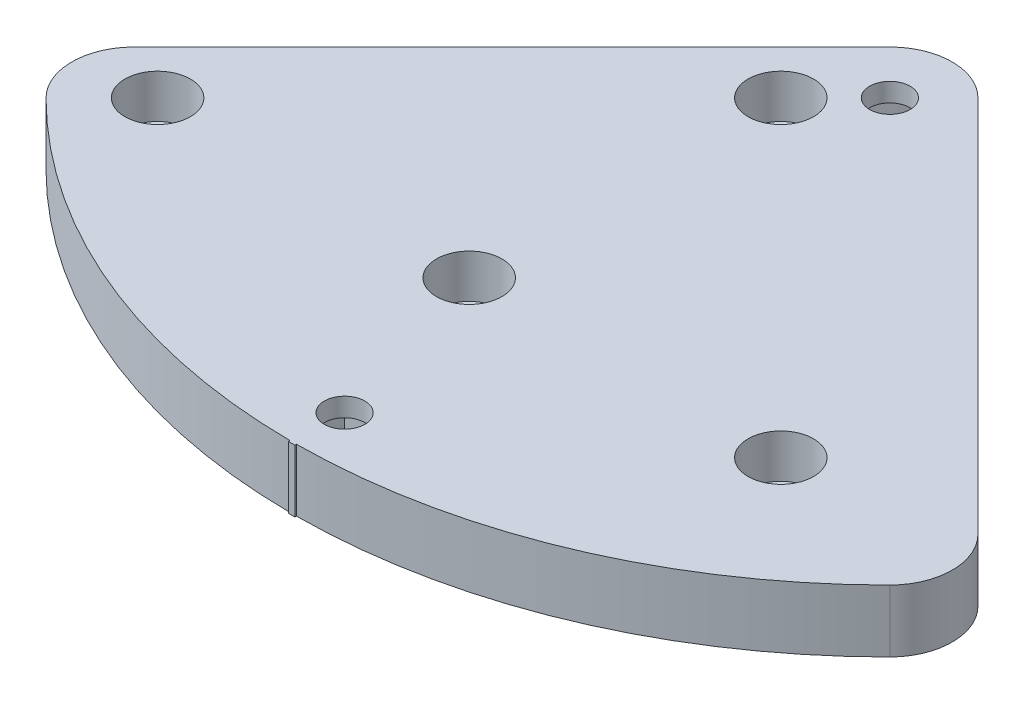
ISO-10303-21;
HEADER;
FILE_DESCRIPTION(('STEP AP214'),'2;1');
FILE_NAME('part.step','',(''),(''),'','','');
FILE_SCHEMA(('AUTOMOTIVE_DESIGN { 1 0 10303 214 1 1 1 1 }'));
ENDSEC;
DATA;
#1=APPLICATION_CONTEXT('core data for automotive mechanical design processes');
#2=APPLICATION_PROTOCOL_DEFINITION('international standard','automotive_design',2000,#1);
#3=PRODUCT_CONTEXT('',#1,'mechanical');
#4=PRODUCT('Part','Part','',(#3));
#5=PRODUCT_RELATED_PRODUCT_CATEGORY('part','',(#4));
#6=PRODUCT_DEFINITION_FORMATION('','',#4);
#7=PRODUCT_DEFINITION_CONTEXT('part definition',#1,'design');
#8=PRODUCT_DEFINITION('design','',#6,#7);
#9=PRODUCT_DEFINITION_SHAPE('','',#8);
#10=(LENGTH_UNIT() NAMED_UNIT(*) SI_UNIT(.MILLI.,.METRE.));
#11=(NAMED_UNIT(*) PLANE_ANGLE_UNIT() SI_UNIT($,.RADIAN.));
#12=(NAMED_UNIT(*) SI_UNIT($,.STERADIAN.) SOLID_ANGLE_UNIT());
#13=UNCERTAINTY_MEASURE_WITH_UNIT(LENGTH_MEASURE(1.E-05),#10,'distance_accuracy_value','');
#14=(GEOMETRIC_REPRESENTATION_CONTEXT(3) GLOBAL_UNCERTAINTY_ASSIGNED_CONTEXT((#13)) GLOBAL_UNIT_ASSIGNED_CONTEXT((#10,
#11,#12)) REPRESENTATION_CONTEXT('',''));
#15=CARTESIAN_POINT('',(0.,0.,0.));
#16=DIRECTION('',(0.,0.,1.));
#17=DIRECTION('',(1.,0.,0.));
#18=AXIS2_PLACEMENT_3D('',#15,#16,#17);
#19=CARTESIAN_POINT('',(0.,10.,0.));
#20=DIRECTION('',(0.,-1.,0.));
#21=DIRECTION('',(0.,0.,-1.));
#22=AXIS2_PLACEMENT_3D('',#19,#20,#21);
#23=CYLINDRICAL_SURFACE('',#22,95.75);
#24=CARTESIAN_POINT('',(0.,0.,0.));
#25=DIRECTION('',(0.,1.,0.));
#26=DIRECTION('',(0.,0.,1.));
#27=AXIS2_PLACEMENT_3D('',#24,#25,#26);
#28=CIRCLE('',#27,95.75);
#29=CARTESIAN_POINT('',(-67.7054742986113,0.,67.7054742986125));
#30=VERTEX_POINT('',#29);
#31=CARTESIAN_POINT('',(-0.503947368421041,0.,95.7486738135305));
#32=VERTEX_POINT('',#31);
#33=EDGE_CURVE('E331',#30,#32,#28,.T.);
#34=ORIENTED_EDGE('',*,*,#33,.T.);
#35=DIRECTION('',(0.,-1.,0.));
#36=VECTOR('',#35,1.);
#37=CARTESIAN_POINT('',(-0.503947368421041,10.,95.7486738135305));
#38=LINE('',#37,#36);
#39=CARTESIAN_POINT('',(-0.503947368421041,10.,95.7486738135305));
#40=VERTEX_POINT('',#39);
#41=EDGE_CURVE('E12',#32,#40,#38,.F.);
#42=ORIENTED_EDGE('',*,*,#41,.T.);
#43=CARTESIAN_POINT('',(0.,10.,0.));
#44=DIRECTION('',(0.,1.,0.));
#45=DIRECTION('',(0.,0.,1.));
#46=AXIS2_PLACEMENT_3D('',#43,#44,#45);
#47=CIRCLE('',#46,95.75);
#48=CARTESIAN_POINT('',(-67.7054742986113,10.,67.7054742986125));
#49=VERTEX_POINT('',#48);
#50=EDGE_CURVE('E317',#49,#40,#47,.T.);
#51=ORIENTED_EDGE('',*,*,#50,.F.);
#52=DIRECTION('',(0.,-1.,0.));
#53=VECTOR('',#52,1.);
#54=CARTESIAN_POINT('',(-67.7054742986113,10.,67.7054742986125));
#55=LINE('',#54,#53);
#56=EDGE_CURVE('E344',#49,#30,#55,.T.);
#57=ORIENTED_EDGE('',*,*,#56,.T.);
#58=EDGE_LOOP('',(#34,#42,#51,#57));
#59=FACE_BOUND('',#58,.T.);
#60=ADVANCED_FACE('F37',(#59),#23,.T.);
#61=CARTESIAN_POINT('',(-8.74999999999999,10.,58.750000000001));
#62=DIRECTION('',(0.,-1.,0.));
#63=DIRECTION('',(0.,0.,-1.));
#64=AXIS2_PLACEMENT_3D('',#61,#62,#63);
#65=CYLINDRICAL_SURFACE('',#64,3.2);
#66=CARTESIAN_POINT('',(-8.74999999999999,0.,58.750000000001));
#67=DIRECTION('',(0.,1.,0.));
#68=DIRECTION('',(0.,0.,1.));
#69=AXIS2_PLACEMENT_3D('',#66,#67,#68);
#70=CIRCLE('',#69,3.2);
#71=CARTESIAN_POINT('',(-8.74999999999999,0.,61.950000000001));
#72=VERTEX_POINT('',#71);
#73=EDGE_CURVE('E305',#72,#72,#70,.T.);
#74=ORIENTED_EDGE('',*,*,#73,.F.);
#75=EDGE_LOOP('',(#74));
#76=FACE_BOUND('',#75,.T.);
#77=CARTESIAN_POINT('',(-8.74999999999999,3.,58.750000000001));
#78=DIRECTION('',(0.,1.,0.));
#79=DIRECTION('',(0.,0.,1.));
#80=AXIS2_PLACEMENT_3D('',#77,#78,#79);
#81=CIRCLE('',#80,3.2);
#82=CARTESIAN_POINT('',(-8.74999999999999,3.,61.950000000001));
#83=VERTEX_POINT('',#82);
#84=EDGE_CURVE('E292',#83,#83,#81,.T.);
#85=ORIENTED_EDGE('',*,*,#84,.T.);
#86=EDGE_LOOP('',(#85));
#87=FACE_BOUND('',#86,.T.);
#88=ADVANCED_FACE('F393',(#76,#87),#65,.F.);
#89=CARTESIAN_POINT('',(-58.75,10.,58.750000000001));
#90=DIRECTION('',(0.,-1.,0.));
#91=DIRECTION('',(0.,0.,-1.));
#92=AXIS2_PLACEMENT_3D('',#89,#90,#91);
#93=CYLINDRICAL_SURFACE('',#92,3.19999999999999);
#94=CARTESIAN_POINT('',(-58.75,0.,58.750000000001));
#95=DIRECTION('',(0.,1.,0.));
#96=DIRECTION('',(0.,0.,1.));
#97=AXIS2_PLACEMENT_3D('',#94,#95,#96);
#98=CIRCLE('',#97,3.19999999999999);
#99=CARTESIAN_POINT('',(-58.75,0.,61.950000000001));
#100=VERTEX_POINT('',#99);
#101=EDGE_CURVE('E299',#100,#100,#98,.T.);
#102=ORIENTED_EDGE('',*,*,#101,.F.);
#103=EDGE_LOOP('',(#102));
#104=FACE_BOUND('',#103,.T.);
#105=CARTESIAN_POINT('',(-58.75,3.,58.750000000001));
#106=DIRECTION('',(0.,1.,0.));
#107=DIRECTION('',(0.,0.,1.));
#108=AXIS2_PLACEMENT_3D('',#105,#106,#107);
#109=CIRCLE('',#108,3.19999999999999);
#110=CARTESIAN_POINT('',(-58.75,3.,61.950000000001));
#111=VERTEX_POINT('',#110);
#112=EDGE_CURVE('E357',#111,#111,#109,.T.);
#113=ORIENTED_EDGE('',*,*,#112,.T.);
#114=EDGE_LOOP('',(#113));
#115=FACE_BOUND('',#114,.T.);
#116=ADVANCED_FACE('F398',(#104,#115),#93,.F.);
#117=CARTESIAN_POINT('',(41.25,10.,58.750000000001));
#118=DIRECTION('',(0.,-1.,0.));
#119=DIRECTION('',(0.,0.,-1.));
#120=AXIS2_PLACEMENT_3D('',#117,#118,#119);
#121=CYLINDRICAL_SURFACE('',#120,3.2);
#122=CARTESIAN_POINT('',(41.25,0.,58.750000000001));
#123=DIRECTION('',(0.,1.,0.));
#124=DIRECTION('',(0.,0.,1.));
#125=AXIS2_PLACEMENT_3D('',#122,#123,#124);
#126=CIRCLE('',#125,3.2);
#127=CARTESIAN_POINT('',(41.25,0.,61.950000000001));
#128=VERTEX_POINT('',#127);
#129=EDGE_CURVE('E296',#128,#128,#126,.T.);
#130=ORIENTED_EDGE('',*,*,#129,.F.);
#131=EDGE_LOOP('',(#130));
#132=FACE_BOUND('',#131,.T.);
#133=CARTESIAN_POINT('',(41.25,3.,58.750000000001));
#134=DIRECTION('',(0.,1.,0.));
#135=DIRECTION('',(0.,0.,1.));
#136=AXIS2_PLACEMENT_3D('',#133,#134,#135);
#137=CIRCLE('',#136,3.2);
#138=CARTESIAN_POINT('',(41.25,3.,61.950000000001));
#139=VERTEX_POINT('',#138);
#140=EDGE_CURVE('E277',#139,#139,#137,.T.);
#141=ORIENTED_EDGE('',*,*,#140,.T.);
#142=EDGE_LOOP('',(#141));
#143=FACE_BOUND('',#142,.T.);
#144=ADVANCED_FACE('F441',(#132,#143),#121,.F.);
#145=CARTESIAN_POINT('',(-8.75,10.,8.75));
#146=DIRECTION('',(0.,-1.,0.));
#147=DIRECTION('',(0.,0.,-1.));
#148=AXIS2_PLACEMENT_3D('',#145,#146,#147);
#149=CYLINDRICAL_SURFACE('',#148,3.2);
#150=CARTESIAN_POINT('',(-8.75,0.,8.75));
#151=DIRECTION('',(0.,1.,0.));
#152=DIRECTION('',(0.,0.,1.));
#153=AXIS2_PLACEMENT_3D('',#150,#151,#152);
#154=CIRCLE('',#153,3.2);
#155=CARTESIAN_POINT('',(-8.75,0.,11.95));
#156=VERTEX_POINT('',#155);
#157=EDGE_CURVE('E302',#156,#156,#154,.T.);
#158=ORIENTED_EDGE('',*,*,#157,.F.);
#159=EDGE_LOOP('',(#158));
#160=FACE_BOUND('',#159,.T.);
#161=CARTESIAN_POINT('',(-8.75,3.,8.75));
#162=DIRECTION('',(0.,1.,0.));
#163=DIRECTION('',(0.,0.,1.));
#164=AXIS2_PLACEMENT_3D('',#161,#162,#163);
#165=CIRCLE('',#164,3.2);
#166=CARTESIAN_POINT('',(-8.75,3.,11.95));
#167=VERTEX_POINT('',#166);
#168=EDGE_CURVE('E295',#167,#167,#165,.T.);
#169=ORIENTED_EDGE('',*,*,#168,.T.);
#170=EDGE_LOOP('',(#169));
#171=FACE_BOUND('',#170,.T.);
#172=ADVANCED_FACE('F421',(#160,#171),#149,.F.);
#173=CARTESIAN_POINT('',(0.,10.,0.));
#174=DIRECTION('',(0.,1.,0.));
#175=DIRECTION('',(0.,0.,1.));
#176=AXIS2_PLACEMENT_3D('',#173,#174,#175);
#177=PLANE('',#176);
#178=ORIENTED_EDGE('',*,*,#50,.T.);
#179=DIRECTION('',(-0.00526315789473671,0.,0.999986149488569));
#180=VECTOR('',#179,1.);
#181=CARTESIAN_POINT('',(-0.505263157894725,10.,95.9986703509026));
#182=LINE('',#181,#180);
#183=CARTESIAN_POINT('',(-0.505263157894725,10.,95.9986703509026));
#184=VERTEX_POINT('',#183);
#185=EDGE_CURVE('E173',#40,#184,#182,.T.);
#186=ORIENTED_EDGE('',*,*,#185,.T.);
#187=CARTESIAN_POINT('',(0.,10.,0.));
#188=DIRECTION('',(0.,1.,0.));
#189=DIRECTION('',(0.,0.,1.));
#190=AXIS2_PLACEMENT_3D('',#187,#188,#189);
#191=CIRCLE('',#190,96.);
#192=CARTESIAN_POINT('',(0.505263157894749,10.,95.9986703509026));
#193=VERTEX_POINT('',#192);
#194=EDGE_CURVE('E168',#184,#193,#191,.T.);
#195=ORIENTED_EDGE('',*,*,#194,.T.);
#196=DIRECTION('',(-0.00526315789473704,0.,-0.999986149488569));
#197=VECTOR('',#196,1.);
#198=CARTESIAN_POINT('',(0.505263157894749,10.,95.9986703509026));
#199=LINE('',#198,#197);
#200=CARTESIAN_POINT('',(0.503947368421065,10.,95.7486738135305));
#201=VERTEX_POINT('',#200);
#202=EDGE_CURVE('E176',#193,#201,#199,.T.);
#203=ORIENTED_EDGE('',*,*,#202,.T.);
#204=CARTESIAN_POINT('',(67.7054742986128,10.,67.7054742986111));
#205=VERTEX_POINT('',#204);
#206=EDGE_CURVE('E52',#201,#205,#47,.T.);
#207=ORIENTED_EDGE('',*,*,#206,.T.);
#208=CARTESIAN_POINT('',(60.6344064867472,10.,60.6344064867457));
#209=DIRECTION('',(0.,1.,0.));
#210=DIRECTION('',(0.,0.,1.));
#211=AXIS2_PLACEMENT_3D('',#208,#209,#210);
#212=CIRCLE('',#211,10.);
#213=CARTESIAN_POINT('',(67.7054742986126,10.,53.5633386748801));
#214=VERTEX_POINT('',#213);
#215=EDGE_CURVE('E319',#205,#214,#212,.T.);
#216=ORIENTED_EDGE('',*,*,#215,.T.);
#217=DIRECTION('',(-0.707106781186556,0.,-0.707106781186539));
#218=VECTOR('',#217,1.);
#219=CARTESIAN_POINT('',(7.07106781186539,10.,-7.07106781186557));
#220=LINE('',#219,#218);
#221=CARTESIAN_POINT('',(7.07106781186539,10.,-7.07106781186557));
#222=VERTEX_POINT('',#221);
#223=EDGE_CURVE('E321',#214,#222,#220,.T.);
#224=ORIENTED_EDGE('',*,*,#223,.T.);
#225=CARTESIAN_POINT('',(0.,10.,0.));
#226=DIRECTION('',(0.,1.,0.));
#227=DIRECTION('',(0.,0.,1.));
#228=AXIS2_PLACEMENT_3D('',#225,#226,#227);
#229=CIRCLE('',#228,10.);
#230=CARTESIAN_POINT('',(-7.07106781186554,10.,-7.07106781186541));
#231=VERTEX_POINT('',#230);
#232=EDGE_CURVE('E309',#222,#231,#229,.T.);
#233=ORIENTED_EDGE('',*,*,#232,.T.);
#234=DIRECTION('',(-0.707106781186541,0.,0.707106781186554));
#235=VECTOR('',#234,1.);
#236=CARTESIAN_POINT('',(-7.07106781186554,10.,-7.07106781186541));
#237=LINE('',#236,#235);
#238=CARTESIAN_POINT('',(-67.7054742986115,10.,53.5633386748816));
#239=VERTEX_POINT('',#238);
#240=EDGE_CURVE('E312',#231,#239,#237,.T.);
#241=ORIENTED_EDGE('',*,*,#240,.T.);
#242=CARTESIAN_POINT('',(-60.6344064867459,10.,60.634406486747));
#243=DIRECTION('',(0.,1.,0.));
#244=DIRECTION('',(0.,0.,1.));
#245=AXIS2_PLACEMENT_3D('',#242,#243,#244);
#246=CIRCLE('',#245,10.);
#247=EDGE_CURVE('E315',#239,#49,#246,.T.);
#248=ORIENTED_EDGE('',*,*,#247,.T.);
#249=EDGE_LOOP('',(#178,#186,#195,#203,#207,#216,#224,#233,#241,#248));
#250=FACE_BOUND('',#249,.T.);
#251=CARTESIAN_POINT('',(0.,10.,87.5));
#252=DIRECTION('',(0.,1.,0.));
#253=DIRECTION('',(0.,0.,1.));
#254=AXIS2_PLACEMENT_3D('',#251,#252,#253);
#255=CIRCLE('',#254,3.25);
#256=CARTESIAN_POINT('',(0.,10.,90.75));
#257=VERTEX_POINT('',#256);
#258=EDGE_CURVE('E244',#257,#257,#255,.T.);
#259=ORIENTED_EDGE('',*,*,#258,.F.);
#260=EDGE_LOOP('',(#259));
#261=FACE_BOUND('',#260,.T.);
#262=CARTESIAN_POINT('',(0.,10.,0.));
#263=DIRECTION('',(0.,1.,0.));
#264=DIRECTION('',(0.,0.,1.));
#265=AXIS2_PLACEMENT_3D('',#262,#263,#264);
#266=CIRCLE('',#265,3.25);
#267=CARTESIAN_POINT('',(0.,10.,3.25));
#268=VERTEX_POINT('',#267);
#269=EDGE_CURVE('E266',#268,#268,#266,.T.);
#270=ORIENTED_EDGE('',*,*,#269,.F.);
#271=EDGE_LOOP('',(#270));
#272=FACE_BOUND('',#271,.T.);
#273=CARTESIAN_POINT('',(-58.75,10.,58.750000000001));
#274=DIRECTION('',(0.,1.,0.));
#275=DIRECTION('',(0.,0.,1.));
#276=AXIS2_PLACEMENT_3D('',#273,#274,#275);
#277=CIRCLE('',#276,5.25);
#278=CARTESIAN_POINT('',(-58.75,10.,64.000000000001));
#279=VERTEX_POINT('',#278);
#280=EDGE_CURVE('E270',#279,#279,#277,.T.);
#281=ORIENTED_EDGE('',*,*,#280,.F.);
#282=EDGE_LOOP('',(#281));
#283=FACE_BOUND('',#282,.T.);
#284=CARTESIAN_POINT('',(41.25,10.,58.750000000001));
#285=DIRECTION('',(0.,1.,0.));
#286=DIRECTION('',(0.,0.,1.));
#287=AXIS2_PLACEMENT_3D('',#284,#285,#286);
#288=CIRCLE('',#287,5.25);
#289=CARTESIAN_POINT('',(41.25,10.,64.000000000001));
#290=VERTEX_POINT('',#289);
#291=EDGE_CURVE('E278',#290,#290,#288,.T.);
#292=ORIENTED_EDGE('',*,*,#291,.F.);
#293=EDGE_LOOP('',(#292));
#294=FACE_BOUND('',#293,.T.);
#295=CARTESIAN_POINT('',(-8.74999999999999,10.,58.750000000001));
#296=DIRECTION('',(0.,1.,0.));
#297=DIRECTION('',(0.,0.,1.));
#298=AXIS2_PLACEMENT_3D('',#295,#296,#297);
#299=CIRCLE('',#298,5.25);
#300=CARTESIAN_POINT('',(-8.74999999999999,10.,64.000000000001));
#301=VERTEX_POINT('',#300);
#302=EDGE_CURVE('E269',#301,#301,#299,.T.);
#303=ORIENTED_EDGE('',*,*,#302,.F.);
#304=EDGE_LOOP('',(#303));
#305=FACE_BOUND('',#304,.T.);
#306=CARTESIAN_POINT('',(-8.75,10.,8.75));
#307=DIRECTION('',(0.,1.,0.));
#308=DIRECTION('',(0.,0.,1.));
#309=AXIS2_PLACEMENT_3D('',#306,#307,#308);
#310=CIRCLE('',#309,5.25);
#311=CARTESIAN_POINT('',(-8.75,10.,14.));
#312=VERTEX_POINT('',#311);
#313=EDGE_CURVE('E288',#312,#312,#310,.T.);
#314=ORIENTED_EDGE('',*,*,#313,.F.);
#315=EDGE_LOOP('',(#314));
#316=FACE_BOUND('',#315,.T.);
#317=ADVANCED_FACE('F180',(#250,#261,#272,#283,#294,#305,#316),#177,.T.);
#318=CARTESIAN_POINT('',(0.,0.,0.));
#319=DIRECTION('',(0.,1.,0.));
#320=DIRECTION('',(0.,0.,1.));
#321=AXIS2_PLACEMENT_3D('',#318,#319,#320);
#322=PLANE('',#321);
#323=DIRECTION('',(0.00526315789473671,0.,-0.999986149488569));
#324=VECTOR('',#323,1.);
#325=CARTESIAN_POINT('',(-0.505263157894725,0.,95.9986703509026));
#326=LINE('',#325,#324);
#327=CARTESIAN_POINT('',(-0.505263157894725,0.,95.9986703509026));
#328=VERTEX_POINT('',#327);
#329=EDGE_CURVE('E189',#328,#32,#326,.T.);
#330=ORIENTED_EDGE('',*,*,#329,.T.);
#331=ORIENTED_EDGE('',*,*,#33,.F.);
#332=CARTESIAN_POINT('',(-60.6344064867459,0.,60.634406486747));
#333=DIRECTION('',(0.,1.,0.));
#334=DIRECTION('',(0.,0.,1.));
#335=AXIS2_PLACEMENT_3D('',#332,#333,#334);
#336=CIRCLE('',#335,10.);
#337=CARTESIAN_POINT('',(-67.7054742986115,0.,53.5633386748816));
#338=VERTEX_POINT('',#337);
#339=EDGE_CURVE('E328',#338,#30,#336,.T.);
#340=ORIENTED_EDGE('',*,*,#339,.F.);
#341=DIRECTION('',(-0.707106781186541,0.,0.707106781186554));
#342=VECTOR('',#341,1.);
#343=CARTESIAN_POINT('',(-7.07106781186554,0.,-7.07106781186541));
#344=LINE('',#343,#342);
#345=CARTESIAN_POINT('',(-7.07106781186554,0.,-7.07106781186541));
#346=VERTEX_POINT('',#345);
#347=EDGE_CURVE('E326',#346,#338,#344,.T.);
#348=ORIENTED_EDGE('',*,*,#347,.F.);
#349=CARTESIAN_POINT('',(0.,0.,0.));
#350=DIRECTION('',(0.,1.,0.));
#351=DIRECTION('',(0.,0.,1.));
#352=AXIS2_PLACEMENT_3D('',#349,#350,#351);
#353=CIRCLE('',#352,10.);
#354=CARTESIAN_POINT('',(7.07106781186539,0.,-7.07106781186557));
#355=VERTEX_POINT('',#354);
#356=EDGE_CURVE('E308',#355,#346,#353,.T.);
#357=ORIENTED_EDGE('',*,*,#356,.F.);
#358=DIRECTION('',(-0.707106781186556,0.,-0.707106781186539));
#359=VECTOR('',#358,1.);
#360=CARTESIAN_POINT('',(7.07106781186539,0.,-7.07106781186557));
#361=LINE('',#360,#359);
#362=CARTESIAN_POINT('',(67.7054742986126,0.,53.5633386748801));
#363=VERTEX_POINT('',#362);
#364=EDGE_CURVE('E313',#363,#355,#361,.T.);
#365=ORIENTED_EDGE('',*,*,#364,.F.);
#366=CARTESIAN_POINT('',(60.6344064867472,0.,60.6344064867457));
#367=DIRECTION('',(0.,1.,0.));
#368=DIRECTION('',(0.,0.,1.));
#369=AXIS2_PLACEMENT_3D('',#366,#367,#368);
#370=CIRCLE('',#369,10.);
#371=CARTESIAN_POINT('',(67.7054742986128,0.,67.7054742986111));
#372=VERTEX_POINT('',#371);
#373=EDGE_CURVE('E333',#372,#363,#370,.T.);
#374=ORIENTED_EDGE('',*,*,#373,.F.);
#375=CARTESIAN_POINT('',(0.503947368421065,0.,95.7486738135305));
#376=VERTEX_POINT('',#375);
#377=EDGE_CURVE('E330',#376,#372,#28,.T.);
#378=ORIENTED_EDGE('',*,*,#377,.F.);
#379=DIRECTION('',(0.00526315789473704,0.,0.999986149488569));
#380=VECTOR('',#379,1.);
#381=CARTESIAN_POINT('',(0.505263157894749,0.,95.9986703509026));
#382=LINE('',#381,#380);
#383=CARTESIAN_POINT('',(0.505263157894749,0.,95.9986703509026));
#384=VERTEX_POINT('',#383);
#385=EDGE_CURVE('E191',#376,#384,#382,.T.);
#386=ORIENTED_EDGE('',*,*,#385,.T.);
#387=CARTESIAN_POINT('',(0.,0.,0.));
#388=DIRECTION('',(0.,1.,0.));
#389=DIRECTION('',(0.,0.,1.));
#390=AXIS2_PLACEMENT_3D('',#387,#388,#389);
#391=CIRCLE('',#390,96.);
#392=EDGE_CURVE('E169',#384,#328,#391,.F.);
#393=ORIENTED_EDGE('',*,*,#392,.T.);
#394=EDGE_LOOP('',(#330,#331,#340,#348,#357,#365,#374,#378,#386,#393));
#395=FACE_BOUND('',#394,.T.);
#396=DIRECTION('',(1.,0.,0.));
#397=VECTOR('',#396,1.);
#398=CARTESIAN_POINT('',(-5.2,0.,82.3));
#399=LINE('',#398,#397);
#400=CARTESIAN_POINT('',(-5.2,0.,82.3));
#401=VERTEX_POINT('',#400);
#402=CARTESIAN_POINT('',(5.2,0.,82.2999999999999));
#403=VERTEX_POINT('',#402);
#404=EDGE_CURVE('E201',#401,#403,#399,.T.);
#405=ORIENTED_EDGE('',*,*,#404,.F.);
#406=DIRECTION('',(0.,0.,-1.));
#407=VECTOR('',#406,1.);
#408=CARTESIAN_POINT('',(-5.2,0.,82.3));
#409=LINE('',#408,#407);
#410=CARTESIAN_POINT('',(-5.2,0.,92.7));
#411=VERTEX_POINT('',#410);
#412=EDGE_CURVE('E204',#411,#401,#409,.T.);
#413=ORIENTED_EDGE('',*,*,#412,.F.);
#414=DIRECTION('',(-1.,0.,0.));
#415=VECTOR('',#414,1.);
#416=CARTESIAN_POINT('',(-5.2,0.,92.7));
#417=LINE('',#416,#415);
#418=CARTESIAN_POINT('',(5.2,0.,92.7));
#419=VERTEX_POINT('',#418);
#420=EDGE_CURVE('E194',#419,#411,#417,.T.);
#421=ORIENTED_EDGE('',*,*,#420,.F.);
#422=DIRECTION('',(0.,0.,1.));
#423=VECTOR('',#422,1.);
#424=CARTESIAN_POINT('',(5.2,0.,82.2999999999999));
#425=LINE('',#424,#423);
#426=EDGE_CURVE('E198',#403,#419,#425,.T.);
#427=ORIENTED_EDGE('',*,*,#426,.F.);
#428=EDGE_LOOP('',(#405,#413,#421,#427));
#429=FACE_BOUND('',#428,.T.);
#430=DIRECTION('',(-0.707106781186547,0.,-0.707106781186547));
#431=VECTOR('',#430,1.);
#432=CARTESIAN_POINT('',(0.,0.,7.3539105243401));
#433=LINE('',#432,#431);
#434=CARTESIAN_POINT('',(0.,0.,7.3539105243401));
#435=VERTEX_POINT('',#434);
#436=CARTESIAN_POINT('',(-7.3539105243401,0.,0.));
#437=VERTEX_POINT('',#436);
#438=EDGE_CURVE('E236',#435,#437,#433,.T.);
#439=ORIENTED_EDGE('',*,*,#438,.F.);
#440=DIRECTION('',(-0.707106781186547,0.,0.707106781186547));
#441=VECTOR('',#440,1.);
#442=CARTESIAN_POINT('',(0.,0.,7.3539105243401));
#443=LINE('',#442,#441);
#444=CARTESIAN_POINT('',(7.3539105243401,0.,0.));
#445=VERTEX_POINT('',#444);
#446=EDGE_CURVE('E239',#445,#435,#443,.T.);
#447=ORIENTED_EDGE('',*,*,#446,.F.);
#448=DIRECTION('',(0.707106781186548,0.,0.707106781186547));
#449=VECTOR('',#448,1.);
#450=CARTESIAN_POINT('',(7.3539105243401,0.,0.));
#451=LINE('',#450,#449);
#452=CARTESIAN_POINT('',(0.,0.,-7.3539105243401));
#453=VERTEX_POINT('',#452);
#454=EDGE_CURVE('E229',#453,#445,#451,.T.);
#455=ORIENTED_EDGE('',*,*,#454,.F.);
#456=DIRECTION('',(0.707106781186548,0.,-0.707106781186547));
#457=VECTOR('',#456,1.);
#458=CARTESIAN_POINT('',(-7.3539105243401,0.,0.));
#459=LINE('',#458,#457);
#460=EDGE_CURVE('E233',#437,#453,#459,.T.);
#461=ORIENTED_EDGE('',*,*,#460,.F.);
#462=EDGE_LOOP('',(#439,#447,#455,#461));
#463=FACE_BOUND('',#462,.T.);
#464=ORIENTED_EDGE('',*,*,#73,.T.);
#465=EDGE_LOOP('',(#464));
#466=FACE_BOUND('',#465,.T.);
#467=ORIENTED_EDGE('',*,*,#157,.T.);
#468=EDGE_LOOP('',(#467));
#469=FACE_BOUND('',#468,.T.);
#470=ORIENTED_EDGE('',*,*,#101,.T.);
#471=EDGE_LOOP('',(#470));
#472=FACE_BOUND('',#471,.T.);
#473=ORIENTED_EDGE('',*,*,#129,.T.);
#474=EDGE_LOOP('',(#473));
#475=FACE_BOUND('',#474,.T.);
#476=ADVANCED_FACE('F364',(#395,#429,#463,#466,#469,#472,#475),#322,.F.);
#477=CARTESIAN_POINT('',(0.,10.,0.));
#478=DIRECTION('',(0.,-1.,0.));
#479=DIRECTION('',(0.,0.,-1.));
#480=AXIS2_PLACEMENT_3D('',#477,#478,#479);
#481=CYLINDRICAL_SURFACE('',#480,10.);
#482=ORIENTED_EDGE('',*,*,#356,.T.);
#483=DIRECTION('',(0.,-1.,0.));
#484=VECTOR('',#483,1.);
#485=CARTESIAN_POINT('',(-7.07106781186554,10.,-7.07106781186541));
#486=LINE('',#485,#484);
#487=EDGE_CURVE('E350',#231,#346,#486,.T.);
#488=ORIENTED_EDGE('',*,*,#487,.F.);
#489=ORIENTED_EDGE('',*,*,#232,.F.);
#490=DIRECTION('',(0.,-1.,0.));
#491=VECTOR('',#490,1.);
#492=CARTESIAN_POINT('',(7.07106781186539,10.,-7.07106781186557));
#493=LINE('',#492,#491);
#494=EDGE_CURVE('E323',#222,#355,#493,.T.);
#495=ORIENTED_EDGE('',*,*,#494,.T.);
#496=EDGE_LOOP('',(#482,#488,#489,#495));
#497=FACE_BOUND('',#496,.T.);
#498=ADVANCED_FACE('F39',(#497),#481,.T.);
#499=CARTESIAN_POINT('',(-7.07106781186554,10.,-7.07106781186541));
#500=DIRECTION('',(0.707106781186554,0.,0.707106781186541));
#501=DIRECTION('',(0.707106781186541,0.,-0.707106781186554));
#502=AXIS2_PLACEMENT_3D('',#499,#500,#501);
#503=PLANE('',#502);
#504=ORIENTED_EDGE('',*,*,#347,.T.);
#505=DIRECTION('',(0.,-1.,0.));
#506=VECTOR('',#505,1.);
#507=CARTESIAN_POINT('',(-67.7054742986115,10.,53.5633386748816));
#508=LINE('',#507,#506);
#509=EDGE_CURVE('E347',#239,#338,#508,.T.);
#510=ORIENTED_EDGE('',*,*,#509,.F.);
#511=ORIENTED_EDGE('',*,*,#240,.F.);
#512=ORIENTED_EDGE('',*,*,#487,.T.);
#513=EDGE_LOOP('',(#504,#510,#511,#512));
#514=FACE_BOUND('',#513,.T.);
#515=ADVANCED_FACE('F383',(#514),#503,.F.);
#516=CARTESIAN_POINT('',(-60.6344064867459,10.,60.634406486747));
#517=DIRECTION('',(0.,-1.,0.));
#518=DIRECTION('',(0.,0.,-1.));
#519=AXIS2_PLACEMENT_3D('',#516,#517,#518);
#520=CYLINDRICAL_SURFACE('',#519,10.);
#521=ORIENTED_EDGE('',*,*,#339,.T.);
#522=ORIENTED_EDGE('',*,*,#56,.F.);
#523=ORIENTED_EDGE('',*,*,#247,.F.);
#524=ORIENTED_EDGE('',*,*,#509,.T.);
#525=EDGE_LOOP('',(#521,#522,#523,#524));
#526=FACE_BOUND('',#525,.T.);
#527=ADVANCED_FACE('F388',(#526),#520,.T.);
#528=ORIENTED_EDGE('',*,*,#206,.F.);
#529=DIRECTION('',(0.,-1.,0.));
#530=VECTOR('',#529,1.);
#531=CARTESIAN_POINT('',(0.503947368421065,10.,95.7486738135305));
#532=LINE('',#531,#530);
#533=EDGE_CURVE('E45',#201,#376,#532,.T.);
#534=ORIENTED_EDGE('',*,*,#533,.T.);
#535=ORIENTED_EDGE('',*,*,#377,.T.);
#536=DIRECTION('',(0.,-1.,0.));
#537=VECTOR('',#536,1.);
#538=CARTESIAN_POINT('',(67.7054742986128,10.,67.7054742986111));
#539=LINE('',#538,#537);
#540=EDGE_CURVE('E341',#205,#372,#539,.T.);
#541=ORIENTED_EDGE('',*,*,#540,.F.);
#542=EDGE_LOOP('',(#528,#534,#535,#541));
#543=FACE_BOUND('',#542,.T.);
#544=ADVANCED_FACE('F361',(#543),#23,.T.);
#545=CARTESIAN_POINT('',(60.6344064867472,10.,60.6344064867457));
#546=DIRECTION('',(0.,-1.,0.));
#547=DIRECTION('',(0.,0.,-1.));
#548=AXIS2_PLACEMENT_3D('',#545,#546,#547);
#549=CYLINDRICAL_SURFACE('',#548,10.);
#550=ORIENTED_EDGE('',*,*,#373,.T.);
#551=DIRECTION('',(0.,-1.,0.));
#552=VECTOR('',#551,1.);
#553=CARTESIAN_POINT('',(67.7054742986126,10.,53.5633386748801));
#554=LINE('',#553,#552);
#555=EDGE_CURVE('E338',#214,#363,#554,.T.);
#556=ORIENTED_EDGE('',*,*,#555,.F.);
#557=ORIENTED_EDGE('',*,*,#215,.F.);
#558=ORIENTED_EDGE('',*,*,#540,.T.);
#559=EDGE_LOOP('',(#550,#556,#557,#558));
#560=FACE_BOUND('',#559,.T.);
#561=ADVANCED_FACE('F372',(#560),#549,.T.);
#562=CARTESIAN_POINT('',(7.07106781186539,10.,-7.07106781186557));
#563=DIRECTION('',(-0.707106781186539,0.,0.707106781186556));
#564=DIRECTION('',(0.707106781186556,0.,0.707106781186539));
#565=AXIS2_PLACEMENT_3D('',#562,#563,#564);
#566=PLANE('',#565);
#567=ORIENTED_EDGE('',*,*,#364,.T.);
#568=ORIENTED_EDGE('',*,*,#494,.F.);
#569=ORIENTED_EDGE('',*,*,#223,.F.);
#570=ORIENTED_EDGE('',*,*,#555,.T.);
#571=EDGE_LOOP('',(#567,#568,#569,#570));
#572=FACE_BOUND('',#571,.T.);
#573=ADVANCED_FACE('F376',(#572),#566,.F.);
#574=CARTESIAN_POINT('',(-8.75,-14.8492424049175,8.75));
#575=DIRECTION('',(0.,1.,0.));
#576=DIRECTION('',(0.,0.,1.));
#577=AXIS2_PLACEMENT_3D('',#574,#575,#576);
#578=CYLINDRICAL_SURFACE('',#577,5.25);
#579=CARTESIAN_POINT('',(-8.75,3.,8.75));
#580=DIRECTION('',(0.,1.,0.));
#581=DIRECTION('',(0.,0.,1.));
#582=AXIS2_PLACEMENT_3D('',#579,#580,#581);
#583=CIRCLE('',#582,5.25);
#584=CARTESIAN_POINT('',(-8.75,3.,14.));
#585=VERTEX_POINT('',#584);
#586=EDGE_CURVE('E291',#585,#585,#583,.F.);
#587=ORIENTED_EDGE('',*,*,#586,.T.);
#588=EDGE_LOOP('',(#587));
#589=FACE_BOUND('',#588,.T.);
#590=ORIENTED_EDGE('',*,*,#313,.T.);
#591=EDGE_LOOP('',(#590));
#592=FACE_BOUND('',#591,.T.);
#593=ADVANCED_FACE('F425',(#589,#592),#578,.F.);
#594=CARTESIAN_POINT('',(0.,3.,0.));
#595=DIRECTION('',(0.,1.,0.));
#596=DIRECTION('',(0.,0.,1.));
#597=AXIS2_PLACEMENT_3D('',#594,#595,#596);
#598=PLANE('',#597);
#599=ORIENTED_EDGE('',*,*,#168,.F.);
#600=EDGE_LOOP('',(#599));
#601=FACE_BOUND('',#600,.T.);
#602=ORIENTED_EDGE('',*,*,#586,.F.);
#603=EDGE_LOOP('',(#602));
#604=FACE_BOUND('',#603,.T.);
#605=ADVANCED_FACE('F429',(#601,#604),#598,.T.);
#606=CARTESIAN_POINT('',(41.25,-14.8492424049175,58.750000000001));
#607=DIRECTION('',(0.,1.,0.));
#608=DIRECTION('',(0.,0.,1.));
#609=AXIS2_PLACEMENT_3D('',#606,#607,#608);
#610=CYLINDRICAL_SURFACE('',#609,5.25);
#611=CARTESIAN_POINT('',(41.25,3.,58.750000000001));
#612=DIRECTION('',(0.,1.,0.));
#613=DIRECTION('',(0.,0.,1.));
#614=AXIS2_PLACEMENT_3D('',#611,#612,#613);
#615=CIRCLE('',#614,5.25);
#616=CARTESIAN_POINT('',(41.25,3.,64.000000000001));
#617=VERTEX_POINT('',#616);
#618=EDGE_CURVE('E274',#617,#617,#615,.F.);
#619=ORIENTED_EDGE('',*,*,#618,.T.);
#620=EDGE_LOOP('',(#619));
#621=FACE_BOUND('',#620,.T.);
#622=ORIENTED_EDGE('',*,*,#291,.T.);
#623=EDGE_LOOP('',(#622));
#624=FACE_BOUND('',#623,.T.);
#625=ADVANCED_FACE('F435',(#621,#624),#610,.F.);
#626=CARTESIAN_POINT('',(0.,3.,0.));
#627=DIRECTION('',(0.,1.,0.));
#628=DIRECTION('',(0.,0.,1.));
#629=AXIS2_PLACEMENT_3D('',#626,#627,#628);
#630=PLANE('',#629);
#631=ORIENTED_EDGE('',*,*,#140,.F.);
#632=EDGE_LOOP('',(#631));
#633=FACE_BOUND('',#632,.T.);
#634=ORIENTED_EDGE('',*,*,#618,.F.);
#635=EDGE_LOOP('',(#634));
#636=FACE_BOUND('',#635,.T.);
#637=ADVANCED_FACE('F465',(#633,#636),#630,.T.);
#638=CARTESIAN_POINT('',(-58.75,-14.8492424049175,58.750000000001));
#639=DIRECTION('',(0.,1.,0.));
#640=DIRECTION('',(0.,0.,1.));
#641=AXIS2_PLACEMENT_3D('',#638,#639,#640);
#642=CYLINDRICAL_SURFACE('',#641,5.25);
#643=CARTESIAN_POINT('',(-58.75,3.,58.750000000001));
#644=DIRECTION('',(0.,1.,0.));
#645=DIRECTION('',(0.,0.,1.));
#646=AXIS2_PLACEMENT_3D('',#643,#644,#645);
#647=CIRCLE('',#646,5.25);
#648=CARTESIAN_POINT('',(-58.75,3.,64.000000000001));
#649=VERTEX_POINT('',#648);
#650=EDGE_CURVE('E273',#649,#649,#647,.F.);
#651=ORIENTED_EDGE('',*,*,#650,.T.);
#652=EDGE_LOOP('',(#651));
#653=FACE_BOUND('',#652,.T.);
#654=ORIENTED_EDGE('',*,*,#280,.T.);
#655=EDGE_LOOP('',(#654));
#656=FACE_BOUND('',#655,.T.);
#657=ADVANCED_FACE('F468',(#653,#656),#642,.F.);
#658=CARTESIAN_POINT('',(0.,3.,0.));
#659=DIRECTION('',(0.,1.,0.));
#660=DIRECTION('',(0.,0.,1.));
#661=AXIS2_PLACEMENT_3D('',#658,#659,#660);
#662=PLANE('',#661);
#663=ORIENTED_EDGE('',*,*,#112,.F.);
#664=EDGE_LOOP('',(#663));
#665=FACE_BOUND('',#664,.T.);
#666=ORIENTED_EDGE('',*,*,#650,.F.);
#667=EDGE_LOOP('',(#666));
#668=FACE_BOUND('',#667,.T.);
#669=ADVANCED_FACE('F485',(#665,#668),#662,.T.);
#670=CARTESIAN_POINT('',(-8.74999999999999,-14.8492424049175,58.750000000001));
#671=DIRECTION('',(0.,1.,0.));
#672=DIRECTION('',(0.,0.,1.));
#673=AXIS2_PLACEMENT_3D('',#670,#671,#672);
#674=CYLINDRICAL_SURFACE('',#673,5.25);
#675=CARTESIAN_POINT('',(-8.74999999999999,3.,58.750000000001));
#676=DIRECTION('',(0.,1.,0.));
#677=DIRECTION('',(0.,0.,1.));
#678=AXIS2_PLACEMENT_3D('',#675,#676,#677);
#679=CIRCLE('',#678,5.25);
#680=CARTESIAN_POINT('',(-8.74999999999999,3.,64.000000000001));
#681=VERTEX_POINT('',#680);
#682=EDGE_CURVE('E281',#681,#681,#679,.F.);
#683=ORIENTED_EDGE('',*,*,#682,.T.);
#684=EDGE_LOOP('',(#683));
#685=FACE_BOUND('',#684,.T.);
#686=ORIENTED_EDGE('',*,*,#302,.T.);
#687=EDGE_LOOP('',(#686));
#688=FACE_BOUND('',#687,.T.);
#689=ADVANCED_FACE('F482',(#685,#688),#674,.F.);
#690=CARTESIAN_POINT('',(0.,3.,0.));
#691=DIRECTION('',(0.,1.,0.));
#692=DIRECTION('',(0.,0.,1.));
#693=AXIS2_PLACEMENT_3D('',#690,#691,#692);
#694=PLANE('',#693);
#695=ORIENTED_EDGE('',*,*,#84,.F.);
#696=EDGE_LOOP('',(#695));
#697=FACE_BOUND('',#696,.T.);
#698=ORIENTED_EDGE('',*,*,#682,.F.);
#699=EDGE_LOOP('',(#698));
#700=FACE_BOUND('',#699,.T.);
#701=ADVANCED_FACE('F484',(#697,#700),#694,.T.);
#702=CARTESIAN_POINT('',(0.,-9.19238815542512,0.));
#703=DIRECTION('',(0.,1.,0.));
#704=DIRECTION('',(0.,0.,1.));
#705=AXIS2_PLACEMENT_3D('',#702,#703,#704);
#706=CYLINDRICAL_SURFACE('',#705,3.25);
#707=CARTESIAN_POINT('',(0.,7.,0.));
#708=DIRECTION('',(0.,1.,0.));
#709=DIRECTION('',(0.,0.,1.));
#710=AXIS2_PLACEMENT_3D('',#707,#708,#709);
#711=CIRCLE('',#710,3.25);
#712=CARTESIAN_POINT('',(0.,7.,3.25));
#713=VERTEX_POINT('',#712);
#714=EDGE_CURVE('E232',#713,#713,#711,.F.);
#715=ORIENTED_EDGE('',*,*,#714,.T.);
#716=EDGE_LOOP('',(#715));
#717=FACE_BOUND('',#716,.T.);
#718=ORIENTED_EDGE('',*,*,#269,.T.);
#719=EDGE_LOOP('',(#718));
#720=FACE_BOUND('',#719,.T.);
#721=ADVANCED_FACE('F491',(#717,#720),#706,.F.);
#722=CARTESIAN_POINT('',(0.,-9.19238815542512,87.5));
#723=DIRECTION('',(0.,1.,0.));
#724=DIRECTION('',(0.,0.,1.));
#725=AXIS2_PLACEMENT_3D('',#722,#723,#724);
#726=CYLINDRICAL_SURFACE('',#725,3.25);
#727=CARTESIAN_POINT('',(0.,7.,87.5));
#728=DIRECTION('',(0.,1.,0.));
#729=DIRECTION('',(0.,0.,1.));
#730=AXIS2_PLACEMENT_3D('',#727,#728,#729);
#731=CIRCLE('',#730,3.25);
#732=CARTESIAN_POINT('',(0.,7.,90.75));
#733=VERTEX_POINT('',#732);
#734=EDGE_CURVE('E197',#733,#733,#731,.F.);
#735=ORIENTED_EDGE('',*,*,#734,.T.);
#736=EDGE_LOOP('',(#735));
#737=FACE_BOUND('',#736,.T.);
#738=ORIENTED_EDGE('',*,*,#258,.T.);
#739=EDGE_LOOP('',(#738));
#740=FACE_BOUND('',#739,.T.);
#741=ADVANCED_FACE('F502',(#737,#740),#726,.F.);
#742=CARTESIAN_POINT('',(0.,30.8,7.3539105243401));
#743=DIRECTION('',(0.707106781186547,0.,0.707106781186547));
#744=DIRECTION('',(0.707106781186548,0.,-0.707106781186548));
#745=AXIS2_PLACEMENT_3D('',#742,#743,#744);
#746=PLANE('',#745);
#747=DIRECTION('',(0.,-1.,0.));
#748=VECTOR('',#747,1.);
#749=CARTESIAN_POINT('',(7.3539105243401,30.8,0.));
#750=LINE('',#749,#748);
#751=CARTESIAN_POINT('',(7.3539105243401,7.,0.));
#752=VERTEX_POINT('',#751);
#753=EDGE_CURVE('E255',#752,#445,#750,.T.);
#754=ORIENTED_EDGE('',*,*,#753,.T.);
#755=ORIENTED_EDGE('',*,*,#446,.T.);
#756=DIRECTION('',(0.,-1.,0.));
#757=VECTOR('',#756,1.);
#758=CARTESIAN_POINT('',(0.,30.8,7.3539105243401));
#759=LINE('',#758,#757);
#760=CARTESIAN_POINT('',(0.,7.,7.3539105243401));
#761=VERTEX_POINT('',#760);
#762=EDGE_CURVE('E251',#761,#435,#759,.T.);
#763=ORIENTED_EDGE('',*,*,#762,.F.);
#764=DIRECTION('',(-0.707106781186548,0.,0.707106781186548));
#765=VECTOR('',#764,1.);
#766=CARTESIAN_POINT('',(0.,7.,7.3539105243401));
#767=LINE('',#766,#765);
#768=EDGE_CURVE('E209',#752,#761,#767,.T.);
#769=ORIENTED_EDGE('',*,*,#768,.F.);
#770=EDGE_LOOP('',(#754,#755,#763,#769));
#771=FACE_BOUND('',#770,.T.);
#772=ADVANCED_FACE('F506',(#771),#746,.F.);
#773=CARTESIAN_POINT('',(7.3539105243401,30.8,0.));
#774=DIRECTION('',(0.707106781186547,0.,-0.707106781186548));
#775=DIRECTION('',(-0.707106781186548,0.,-0.707106781186547));
#776=AXIS2_PLACEMENT_3D('',#773,#774,#775);
#777=PLANE('',#776);
#778=DIRECTION('',(0.,-1.,0.));
#779=VECTOR('',#778,1.);
#780=CARTESIAN_POINT('',(0.,30.8,-7.3539105243401));
#781=LINE('',#780,#779);
#782=CARTESIAN_POINT('',(0.,7.,-7.3539105243401));
#783=VERTEX_POINT('',#782);
#784=EDGE_CURVE('E248',#783,#453,#781,.T.);
#785=ORIENTED_EDGE('',*,*,#784,.T.);
#786=ORIENTED_EDGE('',*,*,#454,.T.);
#787=ORIENTED_EDGE('',*,*,#753,.F.);
#788=DIRECTION('',(0.707106781186548,0.,0.707106781186547));
#789=VECTOR('',#788,1.);
#790=CARTESIAN_POINT('',(7.3539105243401,7.,0.));
#791=LINE('',#790,#789);
#792=EDGE_CURVE('E252',#783,#752,#791,.T.);
#793=ORIENTED_EDGE('',*,*,#792,.F.);
#794=EDGE_LOOP('',(#785,#786,#787,#793));
#795=FACE_BOUND('',#794,.T.);
#796=ADVANCED_FACE('F516',(#795),#777,.F.);
#797=CARTESIAN_POINT('',(-7.3539105243401,30.8,0.));
#798=DIRECTION('',(-0.707106781186547,0.,-0.707106781186548));
#799=DIRECTION('',(-0.707106781186548,0.,0.707106781186547));
#800=AXIS2_PLACEMENT_3D('',#797,#798,#799);
#801=PLANE('',#800);
#802=DIRECTION('',(0.,-1.,0.));
#803=VECTOR('',#802,1.);
#804=CARTESIAN_POINT('',(-7.3539105243401,30.8,0.));
#805=LINE('',#804,#803);
#806=CARTESIAN_POINT('',(-7.3539105243401,7.,0.));
#807=VERTEX_POINT('',#806);
#808=EDGE_CURVE('E241',#807,#437,#805,.T.);
#809=ORIENTED_EDGE('',*,*,#808,.T.);
#810=ORIENTED_EDGE('',*,*,#460,.T.);
#811=ORIENTED_EDGE('',*,*,#784,.F.);
#812=DIRECTION('',(0.707106781186548,0.,-0.707106781186547));
#813=VECTOR('',#812,1.);
#814=CARTESIAN_POINT('',(-7.3539105243401,7.,0.));
#815=LINE('',#814,#813);
#816=EDGE_CURVE('E256',#807,#783,#815,.T.);
#817=ORIENTED_EDGE('',*,*,#816,.F.);
#818=EDGE_LOOP('',(#809,#810,#811,#817));
#819=FACE_BOUND('',#818,.T.);
#820=ADVANCED_FACE('F520',(#819),#801,.F.);
#821=CARTESIAN_POINT('',(0.,30.8,7.3539105243401));
#822=DIRECTION('',(-0.707106781186547,0.,0.707106781186547));
#823=DIRECTION('',(0.707106781186548,0.,0.707106781186548));
#824=AXIS2_PLACEMENT_3D('',#821,#822,#823);
#825=PLANE('',#824);
#826=ORIENTED_EDGE('',*,*,#762,.T.);
#827=ORIENTED_EDGE('',*,*,#438,.T.);
#828=ORIENTED_EDGE('',*,*,#808,.F.);
#829=DIRECTION('',(-0.707106781186548,0.,-0.707106781186548));
#830=VECTOR('',#829,1.);
#831=CARTESIAN_POINT('',(0.,7.,7.3539105243401));
#832=LINE('',#831,#830);
#833=EDGE_CURVE('E245',#761,#807,#832,.T.);
#834=ORIENTED_EDGE('',*,*,#833,.F.);
#835=EDGE_LOOP('',(#826,#827,#828,#834));
#836=FACE_BOUND('',#835,.T.);
#837=ADVANCED_FACE('F512',(#836),#825,.F.);
#838=CARTESIAN_POINT('',(0.,7.,0.));
#839=DIRECTION('',(0.,1.,0.));
#840=DIRECTION('',(0.,0.,1.));
#841=AXIS2_PLACEMENT_3D('',#838,#839,#840);
#842=PLANE('',#841);
#843=ORIENTED_EDGE('',*,*,#768,.T.);
#844=ORIENTED_EDGE('',*,*,#833,.T.);
#845=ORIENTED_EDGE('',*,*,#816,.T.);
#846=ORIENTED_EDGE('',*,*,#792,.T.);
#847=EDGE_LOOP('',(#843,#844,#845,#846));
#848=FACE_BOUND('',#847,.T.);
#849=ORIENTED_EDGE('',*,*,#714,.F.);
#850=EDGE_LOOP('',(#849));
#851=FACE_BOUND('',#850,.T.);
#852=ADVANCED_FACE('F508',(#848,#851),#842,.F.);
#853=CARTESIAN_POINT('',(-5.2,30.8,82.3));
#854=DIRECTION('',(-1.,0.,0.));
#855=DIRECTION('',(0.,0.,1.));
#856=AXIS2_PLACEMENT_3D('',#853,#854,#855);
#857=PLANE('',#856);
#858=DIRECTION('',(0.,-1.,0.));
#859=VECTOR('',#858,1.);
#860=CARTESIAN_POINT('',(-5.2,30.8,92.7));
#861=LINE('',#860,#859);
#862=CARTESIAN_POINT('',(-5.2,7.,92.7));
#863=VERTEX_POINT('',#862);
#864=EDGE_CURVE('E220',#863,#411,#861,.T.);
#865=ORIENTED_EDGE('',*,*,#864,.T.);
#866=ORIENTED_EDGE('',*,*,#412,.T.);
#867=DIRECTION('',(0.,-1.,0.));
#868=VECTOR('',#867,1.);
#869=CARTESIAN_POINT('',(-5.2,30.8,82.3));
#870=LINE('',#869,#868);
#871=CARTESIAN_POINT('',(-5.2,7.,82.3));
#872=VERTEX_POINT('',#871);
#873=EDGE_CURVE('E216',#872,#401,#870,.T.);
#874=ORIENTED_EDGE('',*,*,#873,.F.);
#875=DIRECTION('',(0.,0.,-1.));
#876=VECTOR('',#875,1.);
#877=CARTESIAN_POINT('',(-5.2,7.,82.3));
#878=LINE('',#877,#876);
#879=EDGE_CURVE('E193',#863,#872,#878,.T.);
#880=ORIENTED_EDGE('',*,*,#879,.F.);
#881=EDGE_LOOP('',(#865,#866,#874,#880));
#882=FACE_BOUND('',#881,.T.);
#883=ADVANCED_FACE('F511',(#882),#857,.F.);
#884=CARTESIAN_POINT('',(-5.2,30.8,92.7));
#885=DIRECTION('',(0.,0.,1.));
#886=DIRECTION('',(1.,0.,0.));
#887=AXIS2_PLACEMENT_3D('',#884,#885,#886);
#888=PLANE('',#887);
#889=DIRECTION('',(0.,-1.,0.));
#890=VECTOR('',#889,1.);
#891=CARTESIAN_POINT('',(5.2,30.8,92.7));
#892=LINE('',#891,#890);
#893=CARTESIAN_POINT('',(5.2,7.,92.7));
#894=VERTEX_POINT('',#893);
#895=EDGE_CURVE('E213',#894,#419,#892,.T.);
#896=ORIENTED_EDGE('',*,*,#895,.T.);
#897=ORIENTED_EDGE('',*,*,#420,.T.);
#898=ORIENTED_EDGE('',*,*,#864,.F.);
#899=DIRECTION('',(-1.,0.,0.));
#900=VECTOR('',#899,1.);
#901=CARTESIAN_POINT('',(-5.2,7.,92.7));
#902=LINE('',#901,#900);
#903=EDGE_CURVE('E217',#894,#863,#902,.T.);
#904=ORIENTED_EDGE('',*,*,#903,.F.);
#905=EDGE_LOOP('',(#896,#897,#898,#904));
#906=FACE_BOUND('',#905,.T.);
#907=ADVANCED_FACE('F535',(#906),#888,.F.);
#908=CARTESIAN_POINT('',(5.2,30.8,82.2999999999999));
#909=DIRECTION('',(1.,0.,0.));
#910=DIRECTION('',(0.,0.,-1.));
#911=AXIS2_PLACEMENT_3D('',#908,#909,#910);
#912=PLANE('',#911);
#913=DIRECTION('',(0.,-1.,0.));
#914=VECTOR('',#913,1.);
#915=CARTESIAN_POINT('',(5.2,30.8,82.2999999999999));
#916=LINE('',#915,#914);
#917=CARTESIAN_POINT('',(5.2,7.,82.2999999999999));
#918=VERTEX_POINT('',#917);
#919=EDGE_CURVE('E206',#918,#403,#916,.T.);
#920=ORIENTED_EDGE('',*,*,#919,.T.);
#921=ORIENTED_EDGE('',*,*,#426,.T.);
#922=ORIENTED_EDGE('',*,*,#895,.F.);
#923=DIRECTION('',(0.,0.,1.));
#924=VECTOR('',#923,1.);
#925=CARTESIAN_POINT('',(5.2,7.,82.2999999999999));
#926=LINE('',#925,#924);
#927=EDGE_CURVE('E221',#918,#894,#926,.T.);
#928=ORIENTED_EDGE('',*,*,#927,.F.);
#929=EDGE_LOOP('',(#920,#921,#922,#928));
#930=FACE_BOUND('',#929,.T.);
#931=ADVANCED_FACE('F539',(#930),#912,.F.);
#932=CARTESIAN_POINT('',(-5.2,30.8,82.3));
#933=DIRECTION('',(0.,0.,-1.));
#934=DIRECTION('',(-1.,0.,0.));
#935=AXIS2_PLACEMENT_3D('',#932,#933,#934);
#936=PLANE('',#935);
#937=ORIENTED_EDGE('',*,*,#873,.T.);
#938=ORIENTED_EDGE('',*,*,#404,.T.);
#939=ORIENTED_EDGE('',*,*,#919,.F.);
#940=DIRECTION('',(1.,0.,0.));
#941=VECTOR('',#940,1.);
#942=CARTESIAN_POINT('',(-5.2,7.,82.3));
#943=LINE('',#942,#941);
#944=EDGE_CURVE('E210',#872,#918,#943,.T.);
#945=ORIENTED_EDGE('',*,*,#944,.F.);
#946=EDGE_LOOP('',(#937,#938,#939,#945));
#947=FACE_BOUND('',#946,.T.);
#948=ADVANCED_FACE('F531',(#947),#936,.F.);
#949=CARTESIAN_POINT('',(0.,7.,0.));
#950=DIRECTION('',(0.,1.,0.));
#951=DIRECTION('',(0.,0.,1.));
#952=AXIS2_PLACEMENT_3D('',#949,#950,#951);
#953=PLANE('',#952);
#954=ORIENTED_EDGE('',*,*,#879,.T.);
#955=ORIENTED_EDGE('',*,*,#944,.T.);
#956=ORIENTED_EDGE('',*,*,#927,.T.);
#957=ORIENTED_EDGE('',*,*,#903,.T.);
#958=EDGE_LOOP('',(#954,#955,#956,#957));
#959=FACE_BOUND('',#958,.T.);
#960=ORIENTED_EDGE('',*,*,#734,.F.);
#961=EDGE_LOOP('',(#960));
#962=FACE_BOUND('',#961,.T.);
#963=ADVANCED_FACE('F528',(#959,#962),#953,.F.);
#964=CARTESIAN_POINT('',(-0.505263157894725,-1.42260211000856,95.9986703509026));
#965=DIRECTION('',(-0.999986149488569,0.,-0.00526315789473671));
#966=DIRECTION('',(-0.00526315789473671,0.,0.999986149488569));
#967=AXIS2_PLACEMENT_3D('',#964,#965,#966);
#968=PLANE('',#967);
#969=ORIENTED_EDGE('',*,*,#41,.F.);
#970=ORIENTED_EDGE('',*,*,#329,.F.);
#971=DIRECTION('',(0.,1.,0.));
#972=VECTOR('',#971,1.);
#973=CARTESIAN_POINT('',(-0.505263157894725,-1.42260211000856,95.9986703509026));
#974=LINE('',#973,#972);
#975=EDGE_CURVE('E172',#328,#184,#974,.T.);
#976=ORIENTED_EDGE('',*,*,#975,.T.);
#977=ORIENTED_EDGE('',*,*,#185,.F.);
#978=EDGE_LOOP('',(#969,#970,#976,#977));
#979=FACE_BOUND('',#978,.T.);
#980=ADVANCED_FACE('F390',(#979),#968,.T.);
#981=CARTESIAN_POINT('',(0.505263157894749,-1.42260211000856,95.9986703509026));
#982=DIRECTION('',(0.999986149488569,0.,-0.00526315789473704));
#983=DIRECTION('',(-0.00526315789473704,0.,-0.999986149488569));
#984=AXIS2_PLACEMENT_3D('',#981,#982,#983);
#985=PLANE('',#984);
#986=ORIENTED_EDGE('',*,*,#533,.F.);
#987=ORIENTED_EDGE('',*,*,#202,.F.);
#988=DIRECTION('',(0.,1.,0.));
#989=VECTOR('',#988,1.);
#990=CARTESIAN_POINT('',(0.505263157894749,-1.42260211000856,95.9986703509026));
#991=LINE('',#990,#989);
#992=EDGE_CURVE('E163',#384,#193,#991,.T.);
#993=ORIENTED_EDGE('',*,*,#992,.F.);
#994=ORIENTED_EDGE('',*,*,#385,.F.);
#995=EDGE_LOOP('',(#986,#987,#993,#994));
#996=FACE_BOUND('',#995,.T.);
#997=ADVANCED_FACE('F177',(#996),#985,.T.);
#998=CARTESIAN_POINT('',(0.,-1.42260211000856,0.));
#999=DIRECTION('',(0.,1.,0.));
#1000=DIRECTION('',(0.,0.,1.));
#1001=AXIS2_PLACEMENT_3D('',#998,#999,#1000);
#1002=CYLINDRICAL_SURFACE('',#1001,96.);
#1003=ORIENTED_EDGE('',*,*,#392,.F.);
#1004=ORIENTED_EDGE('',*,*,#992,.T.);
#1005=ORIENTED_EDGE('',*,*,#194,.F.);
#1006=ORIENTED_EDGE('',*,*,#975,.F.);
#1007=EDGE_LOOP('',(#1003,#1004,#1005,#1006));
#1008=FACE_BOUND('',#1007,.T.);
#1009=ADVANCED_FACE('F165',(#1008),#1002,.T.);
#1010=CLOSED_SHELL('',(#60,#88,#116,#144,#172,#317,#476,#498,#515,#527,#544,#561,#573,#593,#605,
#625,#637,#657,#669,#689,#701,#721,#741,#772,#796,#820,#837,#852,#883,#907,#931,#948,#963,#980,
#997,#1009));
#1011=MANIFOLD_SOLID_BREP('B2',#1010);
#1012=ADVANCED_BREP_SHAPE_REPRESENTATION('',(#18,#1011),#14);
#1013=SHAPE_DEFINITION_REPRESENTATION(#9,#1012);
ENDSEC;
END-ISO-10303-21;
